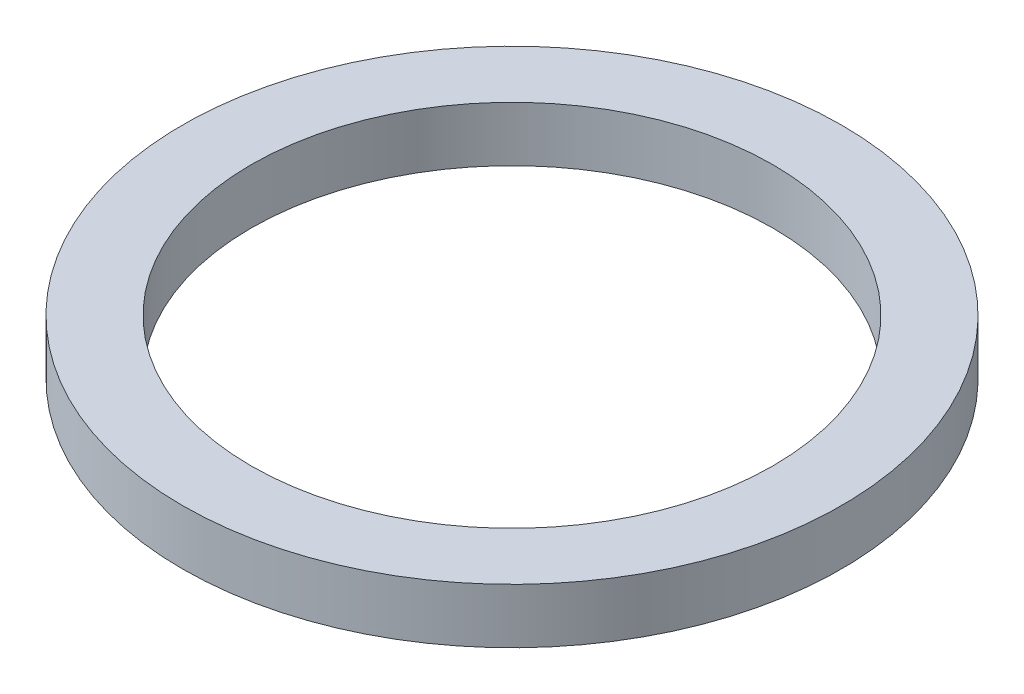
ISO-10303-21;
HEADER;
FILE_DESCRIPTION(('STEP AP214'),'2;1');
FILE_NAME('part.step','',(''),(''),'','','');
FILE_SCHEMA(('AUTOMOTIVE_DESIGN { 1 0 10303 214 1 1 1 1 }'));
ENDSEC;
DATA;
#1=APPLICATION_CONTEXT('core data for automotive mechanical design processes');
#2=APPLICATION_PROTOCOL_DEFINITION('international standard','automotive_design',2000,#1);
#3=PRODUCT_CONTEXT('',#1,'mechanical');
#4=PRODUCT('Part','Part','',(#3));
#5=PRODUCT_RELATED_PRODUCT_CATEGORY('part','',(#4));
#6=PRODUCT_DEFINITION_FORMATION('','',#4);
#7=PRODUCT_DEFINITION_CONTEXT('part definition',#1,'design');
#8=PRODUCT_DEFINITION('design','',#6,#7);
#9=PRODUCT_DEFINITION_SHAPE('','',#8);
#10=(LENGTH_UNIT() NAMED_UNIT(*) SI_UNIT(.MILLI.,.METRE.));
#11=(NAMED_UNIT(*) PLANE_ANGLE_UNIT() SI_UNIT($,.RADIAN.));
#12=(NAMED_UNIT(*) SI_UNIT($,.STERADIAN.) SOLID_ANGLE_UNIT());
#13=UNCERTAINTY_MEASURE_WITH_UNIT(LENGTH_MEASURE(1.E-05),#10,'distance_accuracy_value','');
#14=(GEOMETRIC_REPRESENTATION_CONTEXT(3) GLOBAL_UNCERTAINTY_ASSIGNED_CONTEXT((#13)) GLOBAL_UNIT_ASSIGNED_CONTEXT((#10,
#11,#12)) REPRESENTATION_CONTEXT('',''));
#15=CARTESIAN_POINT('',(0.,0.,0.));
#16=DIRECTION('',(0.,0.,1.));
#17=DIRECTION('',(1.,0.,0.));
#18=AXIS2_PLACEMENT_3D('',#15,#16,#17);
#19=CARTESIAN_POINT('',(0.,10.,0.));
#20=DIRECTION('',(0.,-1.,0.));
#21=DIRECTION('',(0.,0.,-1.));
#22=AXIS2_PLACEMENT_3D('',#19,#20,#21);
#23=CYLINDRICAL_SURFACE('',#22,60.);
#24=CARTESIAN_POINT('',(0.,10.,0.));
#25=DIRECTION('',(0.,1.,0.));
#26=DIRECTION('',(0.,0.,1.));
#27=AXIS2_PLACEMENT_3D('',#24,#25,#26);
#28=CIRCLE('',#27,60.);
#29=CARTESIAN_POINT('',(0.,10.,60.));
#30=VERTEX_POINT('',#29);
#31=EDGE_CURVE('E10',#30,#30,#28,.T.);
#32=ORIENTED_EDGE('',*,*,#31,.F.);
#33=EDGE_LOOP('',(#32));
#34=FACE_BOUND('',#33,.T.);
#35=CARTESIAN_POINT('',(0.,0.,0.));
#36=DIRECTION('',(0.,1.,0.));
#37=DIRECTION('',(0.,0.,1.));
#38=AXIS2_PLACEMENT_3D('',#35,#36,#37);
#39=CIRCLE('',#38,60.);
#40=CARTESIAN_POINT('',(0.,0.,60.));
#41=VERTEX_POINT('',#40);
#42=EDGE_CURVE('E37',#41,#41,#39,.T.);
#43=ORIENTED_EDGE('',*,*,#42,.T.);
#44=EDGE_LOOP('',(#43));
#45=FACE_BOUND('',#44,.T.);
#46=ADVANCED_FACE('F40',(#34,#45),#23,.T.);
#47=CARTESIAN_POINT('',(0.,10.,0.));
#48=DIRECTION('',(0.,1.,0.));
#49=DIRECTION('',(0.,0.,1.));
#50=AXIS2_PLACEMENT_3D('',#47,#48,#49);
#51=PLANE('',#50);
#52=CARTESIAN_POINT('',(0.,10.,0.));
#53=DIRECTION('',(0.,1.,0.));
#54=DIRECTION('',(0.,0.,1.));
#55=AXIS2_PLACEMENT_3D('',#52,#53,#54);
#56=CIRCLE('',#55,47.5);
#57=CARTESIAN_POINT('',(0.,10.,47.5));
#58=VERTEX_POINT('',#57);
#59=EDGE_CURVE('E50',#58,#58,#56,.T.);
#60=ORIENTED_EDGE('',*,*,#59,.F.);
#61=EDGE_LOOP('',(#60));
#62=FACE_BOUND('',#61,.T.);
#63=ORIENTED_EDGE('',*,*,#31,.T.);
#64=EDGE_LOOP('',(#63));
#65=FACE_BOUND('',#64,.T.);
#66=ADVANCED_FACE('F59',(#62,#65),#51,.T.);
#67=CARTESIAN_POINT('',(0.,0.,0.));
#68=DIRECTION('',(0.,1.,0.));
#69=DIRECTION('',(0.,0.,1.));
#70=AXIS2_PLACEMENT_3D('',#67,#68,#69);
#71=PLANE('',#70);
#72=CARTESIAN_POINT('',(0.,0.,0.));
#73=DIRECTION('',(0.,1.,0.));
#74=DIRECTION('',(0.,0.,1.));
#75=AXIS2_PLACEMENT_3D('',#72,#73,#74);
#76=CIRCLE('',#75,47.5);
#77=CARTESIAN_POINT('',(0.,0.,47.5));
#78=VERTEX_POINT('',#77);
#79=EDGE_CURVE('E47',#78,#78,#76,.T.);
#80=ORIENTED_EDGE('',*,*,#79,.T.);
#81=EDGE_LOOP('',(#80));
#82=FACE_BOUND('',#81,.T.);
#83=ORIENTED_EDGE('',*,*,#42,.F.);
#84=EDGE_LOOP('',(#83));
#85=FACE_BOUND('',#84,.T.);
#86=ADVANCED_FACE('F58',(#82,#85),#71,.F.);
#87=CARTESIAN_POINT('',(0.,10.,0.));
#88=DIRECTION('',(0.,-1.,0.));
#89=DIRECTION('',(0.,0.,-1.));
#90=AXIS2_PLACEMENT_3D('',#87,#88,#89);
#91=CYLINDRICAL_SURFACE('',#90,47.5);
#92=ORIENTED_EDGE('',*,*,#59,.T.);
#93=EDGE_LOOP('',(#92));
#94=FACE_BOUND('',#93,.T.);
#95=ORIENTED_EDGE('',*,*,#79,.F.);
#96=EDGE_LOOP('',(#95));
#97=FACE_BOUND('',#96,.T.);
#98=ADVANCED_FACE('F54',(#94,#97),#91,.F.);
#99=CLOSED_SHELL('',(#46,#66,#86,#98));
#100=MANIFOLD_SOLID_BREP('B2',#99);
#101=ADVANCED_BREP_SHAPE_REPRESENTATION('',(#18,#100),#14);
#102=SHAPE_DEFINITION_REPRESENTATION(#9,#101);
ENDSEC;
END-ISO-10303-21;
